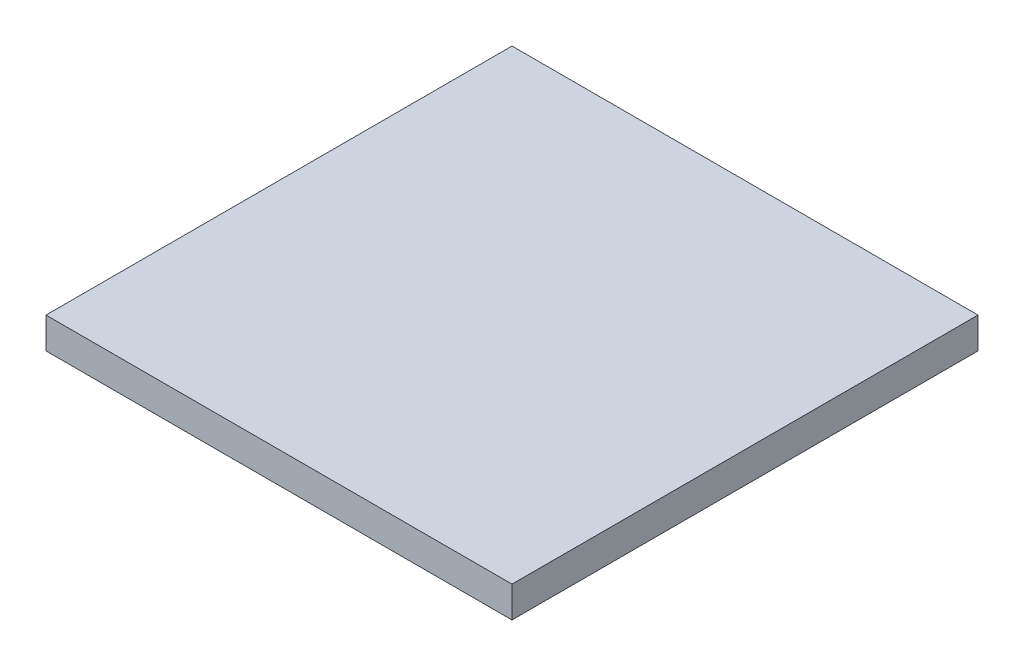
ISO-10303-21;
HEADER;
FILE_DESCRIPTION(('STEP AP214'),'2;1');
FILE_NAME('part.step','',(''),(''),'','','');
FILE_SCHEMA(('AUTOMOTIVE_DESIGN { 1 0 10303 214 1 1 1 1 }'));
ENDSEC;
DATA;
#1=APPLICATION_CONTEXT('core data for automotive mechanical design processes');
#2=APPLICATION_PROTOCOL_DEFINITION('international standard','automotive_design',2000,#1);
#3=PRODUCT_CONTEXT('',#1,'mechanical');
#4=PRODUCT('Part','Part','',(#3));
#5=PRODUCT_RELATED_PRODUCT_CATEGORY('part','',(#4));
#6=PRODUCT_DEFINITION_FORMATION('','',#4);
#7=PRODUCT_DEFINITION_CONTEXT('part definition',#1,'design');
#8=PRODUCT_DEFINITION('design','',#6,#7);
#9=PRODUCT_DEFINITION_SHAPE('','',#8);
#10=(LENGTH_UNIT() NAMED_UNIT(*) SI_UNIT(.MILLI.,.METRE.));
#11=(NAMED_UNIT(*) PLANE_ANGLE_UNIT() SI_UNIT($,.RADIAN.));
#12=(NAMED_UNIT(*) SI_UNIT($,.STERADIAN.) SOLID_ANGLE_UNIT());
#13=UNCERTAINTY_MEASURE_WITH_UNIT(LENGTH_MEASURE(1.E-05),#10,'distance_accuracy_value','');
#14=(GEOMETRIC_REPRESENTATION_CONTEXT(3) GLOBAL_UNCERTAINTY_ASSIGNED_CONTEXT((#13)) GLOBAL_UNIT_ASSIGNED_CONTEXT((#10,
#11,#12)) REPRESENTATION_CONTEXT('',''));
#15=CARTESIAN_POINT('',(0.,0.,0.));
#16=DIRECTION('',(0.,0.,1.));
#17=DIRECTION('',(1.,0.,0.));
#18=AXIS2_PLACEMENT_3D('',#15,#16,#17);
#19=CARTESIAN_POINT('',(15.,2.,-15.));
#20=DIRECTION('',(-1.,0.,0.));
#21=DIRECTION('',(0.,0.,1.));
#22=AXIS2_PLACEMENT_3D('',#19,#20,#21);
#23=PLANE('',#22);
#24=DIRECTION('',(0.,0.,-1.));
#25=VECTOR('',#24,1.);
#26=CARTESIAN_POINT('',(15.,0.,-15.));
#27=LINE('',#26,#25);
#28=CARTESIAN_POINT('',(15.,0.,15.));
#29=VERTEX_POINT('',#28);
#30=CARTESIAN_POINT('',(15.,0.,-15.));
#31=VERTEX_POINT('',#30);
#32=EDGE_CURVE('E98',#29,#31,#27,.T.);
#33=ORIENTED_EDGE('',*,*,#32,.T.);
#34=DIRECTION('',(0.,-1.,0.));
#35=VECTOR('',#34,1.);
#36=CARTESIAN_POINT('',(15.,2.,-15.));
#37=LINE('',#36,#35);
#38=CARTESIAN_POINT('',(15.,2.,-15.));
#39=VERTEX_POINT('',#38);
#40=EDGE_CURVE('E11',#39,#31,#37,.T.);
#41=ORIENTED_EDGE('',*,*,#40,.F.);
#42=DIRECTION('',(0.,0.,-1.));
#43=VECTOR('',#42,1.);
#44=CARTESIAN_POINT('',(15.,2.,-15.));
#45=LINE('',#44,#43);
#46=CARTESIAN_POINT('',(15.,2.,15.));
#47=VERTEX_POINT('',#46);
#48=EDGE_CURVE('E86',#47,#39,#45,.T.);
#49=ORIENTED_EDGE('',*,*,#48,.F.);
#50=DIRECTION('',(0.,-1.,0.));
#51=VECTOR('',#50,1.);
#52=CARTESIAN_POINT('',(15.,2.,15.));
#53=LINE('',#52,#51);
#54=EDGE_CURVE('E94',#47,#29,#53,.T.);
#55=ORIENTED_EDGE('',*,*,#54,.T.);
#56=EDGE_LOOP('',(#33,#41,#49,#55));
#57=FACE_BOUND('',#56,.T.);
#58=ADVANCED_FACE('F35',(#57),#23,.F.);
#59=CARTESIAN_POINT('',(-15.,2.,-15.));
#60=DIRECTION('',(0.,0.,1.));
#61=DIRECTION('',(1.,0.,0.));
#62=AXIS2_PLACEMENT_3D('',#59,#60,#61);
#63=PLANE('',#62);
#64=DIRECTION('',(-1.,0.,0.));
#65=VECTOR('',#64,1.);
#66=CARTESIAN_POINT('',(-15.,0.,-15.));
#67=LINE('',#66,#65);
#68=CARTESIAN_POINT('',(-15.,0.,-15.));
#69=VERTEX_POINT('',#68);
#70=EDGE_CURVE('E90',#31,#69,#67,.T.);
#71=ORIENTED_EDGE('',*,*,#70,.T.);
#72=DIRECTION('',(0.,-1.,0.));
#73=VECTOR('',#72,1.);
#74=CARTESIAN_POINT('',(-15.,2.,-15.));
#75=LINE('',#74,#73);
#76=CARTESIAN_POINT('',(-15.,2.,-15.));
#77=VERTEX_POINT('',#76);
#78=EDGE_CURVE('E43',#77,#69,#75,.T.);
#79=ORIENTED_EDGE('',*,*,#78,.F.);
#80=DIRECTION('',(-1.,0.,0.));
#81=VECTOR('',#80,1.);
#82=CARTESIAN_POINT('',(-15.,2.,-15.));
#83=LINE('',#82,#81);
#84=EDGE_CURVE('E81',#39,#77,#83,.T.);
#85=ORIENTED_EDGE('',*,*,#84,.F.);
#86=ORIENTED_EDGE('',*,*,#40,.T.);
#87=EDGE_LOOP('',(#71,#79,#85,#86));
#88=FACE_BOUND('',#87,.T.);
#89=ADVANCED_FACE('F89',(#88),#63,.F.);
#90=CARTESIAN_POINT('',(-15.,2.,-15.));
#91=DIRECTION('',(1.,0.,0.));
#92=DIRECTION('',(0.,0.,-1.));
#93=AXIS2_PLACEMENT_3D('',#90,#91,#92);
#94=PLANE('',#93);
#95=DIRECTION('',(0.,0.,1.));
#96=VECTOR('',#95,1.);
#97=CARTESIAN_POINT('',(-15.,0.,-15.));
#98=LINE('',#97,#96);
#99=CARTESIAN_POINT('',(-15.,0.,15.));
#100=VERTEX_POINT('',#99);
#101=EDGE_CURVE('E68',#69,#100,#98,.T.);
#102=ORIENTED_EDGE('',*,*,#101,.T.);
#103=DIRECTION('',(0.,-1.,0.));
#104=VECTOR('',#103,1.);
#105=CARTESIAN_POINT('',(-15.,2.,15.));
#106=LINE('',#105,#104);
#107=CARTESIAN_POINT('',(-15.,2.,15.));
#108=VERTEX_POINT('',#107);
#109=EDGE_CURVE('E91',#108,#100,#106,.T.);
#110=ORIENTED_EDGE('',*,*,#109,.F.);
#111=DIRECTION('',(0.,0.,1.));
#112=VECTOR('',#111,1.);
#113=CARTESIAN_POINT('',(-15.,2.,-15.));
#114=LINE('',#113,#112);
#115=EDGE_CURVE('E84',#77,#108,#114,.T.);
#116=ORIENTED_EDGE('',*,*,#115,.F.);
#117=ORIENTED_EDGE('',*,*,#78,.T.);
#118=EDGE_LOOP('',(#102,#110,#116,#117));
#119=FACE_BOUND('',#118,.T.);
#120=ADVANCED_FACE('F92',(#119),#94,.F.);
#121=CARTESIAN_POINT('',(-15.,2.,15.));
#122=DIRECTION('',(0.,0.,-1.));
#123=DIRECTION('',(-1.,0.,0.));
#124=AXIS2_PLACEMENT_3D('',#121,#122,#123);
#125=PLANE('',#124);
#126=DIRECTION('',(1.,0.,0.));
#127=VECTOR('',#126,1.);
#128=CARTESIAN_POINT('',(-15.,0.,15.));
#129=LINE('',#128,#127);
#130=EDGE_CURVE('E74',#100,#29,#129,.T.);
#131=ORIENTED_EDGE('',*,*,#130,.T.);
#132=ORIENTED_EDGE('',*,*,#54,.F.);
#133=DIRECTION('',(1.,0.,0.));
#134=VECTOR('',#133,1.);
#135=CARTESIAN_POINT('',(-15.,2.,15.));
#136=LINE('',#135,#134);
#137=EDGE_CURVE('E51',#108,#47,#136,.T.);
#138=ORIENTED_EDGE('',*,*,#137,.F.);
#139=ORIENTED_EDGE('',*,*,#109,.T.);
#140=EDGE_LOOP('',(#131,#132,#138,#139));
#141=FACE_BOUND('',#140,.T.);
#142=ADVANCED_FACE('F105',(#141),#125,.F.);
#143=CARTESIAN_POINT('',(0.,2.,0.));
#144=DIRECTION('',(0.,1.,0.));
#145=DIRECTION('',(0.,0.,1.));
#146=AXIS2_PLACEMENT_3D('',#143,#144,#145);
#147=PLANE('',#146);
#148=ORIENTED_EDGE('',*,*,#48,.T.);
#149=ORIENTED_EDGE('',*,*,#84,.T.);
#150=ORIENTED_EDGE('',*,*,#115,.T.);
#151=ORIENTED_EDGE('',*,*,#137,.T.);
#152=EDGE_LOOP('',(#148,#149,#150,#151));
#153=FACE_BOUND('',#152,.T.);
#154=ADVANCED_FACE('F82',(#153),#147,.T.);
#155=CARTESIAN_POINT('',(0.,0.,0.));
#156=DIRECTION('',(0.,1.,0.));
#157=DIRECTION('',(0.,0.,1.));
#158=AXIS2_PLACEMENT_3D('',#155,#156,#157);
#159=PLANE('',#158);
#160=ORIENTED_EDGE('',*,*,#32,.F.);
#161=ORIENTED_EDGE('',*,*,#130,.F.);
#162=ORIENTED_EDGE('',*,*,#101,.F.);
#163=ORIENTED_EDGE('',*,*,#70,.F.);
#164=EDGE_LOOP('',(#160,#161,#162,#163));
#165=FACE_BOUND('',#164,.T.);
#166=ADVANCED_FACE('F108',(#165),#159,.F.);
#167=CLOSED_SHELL('',(#58,#89,#120,#142,#154,#166));
#168=MANIFOLD_SOLID_BREP('B2',#167);
#169=ADVANCED_BREP_SHAPE_REPRESENTATION('',(#18,#168),#14);
#170=SHAPE_DEFINITION_REPRESENTATION(#9,#169);
ENDSEC;
END-ISO-10303-21;
